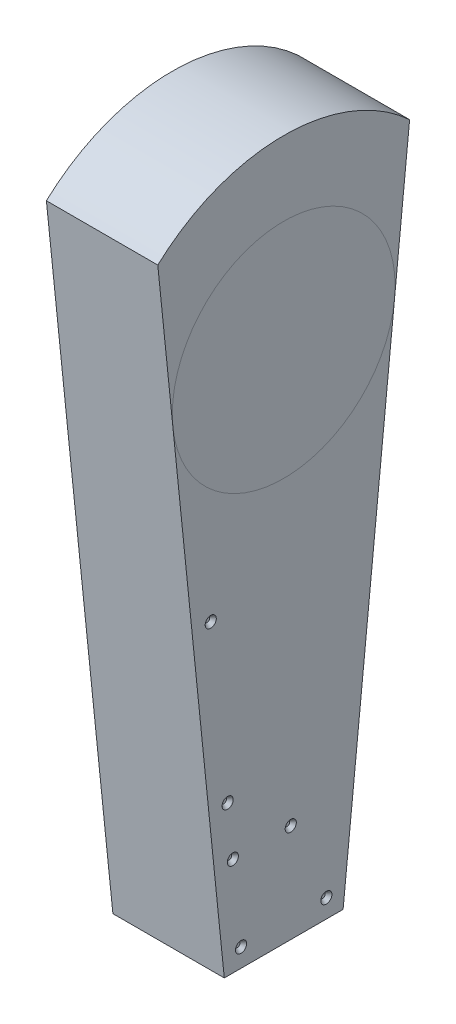
ISO-10303-21;
HEADER;
FILE_DESCRIPTION(('STEP AP214'),'2;1');
FILE_NAME('part.step','',(''),(''),'','','');
FILE_SCHEMA(('AUTOMOTIVE_DESIGN { 1 0 10303 214 1 1 1 1 }'));
ENDSEC;
DATA;
#1=APPLICATION_CONTEXT('core data for automotive mechanical design processes');
#2=APPLICATION_PROTOCOL_DEFINITION('international standard','automotive_design',2000,#1);
#3=PRODUCT_CONTEXT('',#1,'mechanical');
#4=PRODUCT('Part','Part','',(#3));
#5=PRODUCT_RELATED_PRODUCT_CATEGORY('part','',(#4));
#6=PRODUCT_DEFINITION_FORMATION('','',#4);
#7=PRODUCT_DEFINITION_CONTEXT('part definition',#1,'design');
#8=PRODUCT_DEFINITION('design','',#6,#7);
#9=PRODUCT_DEFINITION_SHAPE('','',#8);
#10=(LENGTH_UNIT() NAMED_UNIT(*) SI_UNIT(.MILLI.,.METRE.));
#11=(NAMED_UNIT(*) PLANE_ANGLE_UNIT() SI_UNIT($,.RADIAN.));
#12=(NAMED_UNIT(*) SI_UNIT($,.STERADIAN.) SOLID_ANGLE_UNIT());
#13=UNCERTAINTY_MEASURE_WITH_UNIT(LENGTH_MEASURE(1.E-05),#10,'distance_accuracy_value','');
#14=(GEOMETRIC_REPRESENTATION_CONTEXT(3) GLOBAL_UNCERTAINTY_ASSIGNED_CONTEXT((#13)) GLOBAL_UNIT_ASSIGNED_CONTEXT((#10,
#11,#12)) REPRESENTATION_CONTEXT('',''));
#15=CARTESIAN_POINT('',(0.,0.,0.));
#16=DIRECTION('',(0.,0.,1.));
#17=DIRECTION('',(1.,0.,0.));
#18=AXIS2_PLACEMENT_3D('',#15,#16,#17);
#19=CARTESIAN_POINT('',(76.2,-351.790000010146,40.64));
#20=DIRECTION('',(0.,1.,0.));
#21=DIRECTION('',(0.,0.,1.));
#22=AXIS2_PLACEMENT_3D('',#19,#20,#21);
#23=PLANE('',#22);
#24=DIRECTION('',(0.,0.,-1.));
#25=VECTOR('',#24,1.);
#26=CARTESIAN_POINT('',(0.,-351.790000010146,40.64));
#27=LINE('',#26,#25);
#28=CARTESIAN_POINT('',(0.,-351.790000010146,40.64));
#29=VERTEX_POINT('',#28);
#30=CARTESIAN_POINT('',(0.,-351.790000010146,-40.64));
#31=VERTEX_POINT('',#30);
#32=EDGE_CURVE('E102',#29,#31,#27,.T.);
#33=ORIENTED_EDGE('',*,*,#32,.T.);
#34=DIRECTION('',(-1.,0.,0.));
#35=VECTOR('',#34,1.);
#36=CARTESIAN_POINT('',(76.2,-351.790000010146,-40.64));
#37=LINE('',#36,#35);
#38=CARTESIAN_POINT('',(76.2,-351.790000010146,-40.64));
#39=VERTEX_POINT('',#38);
#40=EDGE_CURVE('E84',#39,#31,#37,.T.);
#41=ORIENTED_EDGE('',*,*,#40,.F.);
#42=DIRECTION('',(0.,0.,-1.));
#43=VECTOR('',#42,1.);
#44=CARTESIAN_POINT('',(76.2,-351.790000010146,40.64));
#45=LINE('',#44,#43);
#46=CARTESIAN_POINT('',(76.2,-351.790000010146,40.64));
#47=VERTEX_POINT('',#46);
#48=EDGE_CURVE('E91',#47,#39,#45,.T.);
#49=ORIENTED_EDGE('',*,*,#48,.F.);
#50=DIRECTION('',(-1.,0.,0.));
#51=VECTOR('',#50,1.);
#52=CARTESIAN_POINT('',(76.2,-351.790000010146,40.64));
#53=LINE('',#52,#51);
#54=EDGE_CURVE('E113',#47,#29,#53,.T.);
#55=ORIENTED_EDGE('',*,*,#54,.T.);
#56=EDGE_LOOP('',(#33,#41,#49,#55));
#57=FACE_BOUND('',#56,.T.);
#58=CARTESIAN_POINT('',(38.1,-351.790000010146,0.));
#59=DIRECTION('',(0.,1.,0.));
#60=DIRECTION('',(0.,0.,1.));
#61=AXIS2_PLACEMENT_3D('',#58,#59,#60);
#62=CIRCLE('',#61,25.4);
#63=CARTESIAN_POINT('',(38.1,-351.790000010146,25.4));
#64=VERTEX_POINT('',#63);
#65=EDGE_CURVE('E11',#64,#64,#62,.F.);
#66=ORIENTED_EDGE('',*,*,#65,.F.);
#67=EDGE_LOOP('',(#66));
#68=FACE_BOUND('',#67,.T.);
#69=ADVANCED_FACE('F35',(#57,#68),#23,.F.);
#70=CARTESIAN_POINT('',(76.2,0.,0.));
#71=DIRECTION('',(1.,0.,0.));
#72=DIRECTION('',(0.,0.,-1.));
#73=AXIS2_PLACEMENT_3D('',#70,#71,#72);
#74=PLANE('',#73);
#75=CARTESIAN_POINT('',(76.2,-284.339077712489,-4.8194607374854));
#76=DIRECTION('',(1.,0.,0.));
#77=DIRECTION('',(0.,0.,-1.));
#78=AXIS2_PLACEMENT_3D('',#75,#76,#77);
#79=CIRCLE('',#78,3.81);
#80=CARTESIAN_POINT('',(76.2,-284.339077712489,-8.6294607374854));
#81=VERTEX_POINT('',#80);
#82=EDGE_CURVE('E158',#81,#81,#79,.T.);
#83=ORIENTED_EDGE('',*,*,#82,.F.);
#84=EDGE_LOOP('',(#83));
#85=FACE_BOUND('',#84,.T.);
#86=CARTESIAN_POINT('',(76.2,-339.090000010146,-29.1719194246492));
#87=DIRECTION('',(1.,0.,0.));
#88=DIRECTION('',(0.,0.,-1.));
#89=AXIS2_PLACEMENT_3D('',#86,#87,#88);
#90=CIRCLE('',#89,3.80999999999999);
#91=CARTESIAN_POINT('',(76.2,-339.090000010146,-32.9819194246492));
#92=VERTEX_POINT('',#91);
#93=EDGE_CURVE('E152',#92,#92,#90,.T.);
#94=ORIENTED_EDGE('',*,*,#93,.F.);
#95=EDGE_LOOP('',(#94));
#96=FACE_BOUND('',#95,.T.);
#97=CARTESIAN_POINT('',(76.2,-339.090000010146,29.1719194246491));
#98=DIRECTION('',(1.,0.,0.));
#99=DIRECTION('',(0.,0.,-1.));
#100=AXIS2_PLACEMENT_3D('',#97,#98,#99);
#101=CIRCLE('',#100,3.81);
#102=CARTESIAN_POINT('',(76.2,-339.090000010146,25.3619194246491));
#103=VERTEX_POINT('',#102);
#104=EDGE_CURVE('E146',#103,#103,#101,.T.);
#105=ORIENTED_EDGE('',*,*,#104,.F.);
#106=EDGE_LOOP('',(#105));
#107=FACE_BOUND('',#106,.T.);
#108=CARTESIAN_POINT('',(76.2,-284.339077712489,34.768096530757));
#109=DIRECTION('',(1.,0.,0.));
#110=DIRECTION('',(0.,0.,-1.));
#111=AXIS2_PLACEMENT_3D('',#108,#109,#110);
#112=CIRCLE('',#111,3.81);
#113=CARTESIAN_POINT('',(76.2,-284.339077712489,30.958096530757));
#114=VERTEX_POINT('',#113);
#115=EDGE_CURVE('E140',#114,#114,#112,.T.);
#116=ORIENTED_EDGE('',*,*,#115,.F.);
#117=EDGE_LOOP('',(#116));
#118=FACE_BOUND('',#117,.T.);
#119=CARTESIAN_POINT('',(76.2,-249.174001321091,38.3623737991144));
#120=DIRECTION('',(1.,0.,0.));
#121=DIRECTION('',(0.,0.,-1.));
#122=AXIS2_PLACEMENT_3D('',#119,#120,#121);
#123=CIRCLE('',#122,3.81);
#124=CARTESIAN_POINT('',(76.2,-249.174001321091,34.5523737991144));
#125=VERTEX_POINT('',#124);
#126=EDGE_CURVE('E134',#125,#125,#123,.T.);
#127=ORIENTED_EDGE('',*,*,#126,.F.);
#128=EDGE_LOOP('',(#127));
#129=FACE_BOUND('',#128,.T.);
#130=CARTESIAN_POINT('',(76.2,-136.12684472737,49.9170998766228));
#131=DIRECTION('',(1.,0.,0.));
#132=DIRECTION('',(0.,0.,-1.));
#133=AXIS2_PLACEMENT_3D('',#130,#131,#132);
#134=CIRCLE('',#133,3.81);
#135=CARTESIAN_POINT('',(76.2,-136.12684472737,46.1070998766228));
#136=VERTEX_POINT('',#135);
#137=EDGE_CURVE('E128',#136,#136,#134,.T.);
#138=ORIENTED_EDGE('',*,*,#137,.F.);
#139=EDGE_LOOP('',(#138));
#140=FACE_BOUND('',#139,.T.);
#141=DIRECTION('',(0.,0.994816974553797,-0.101681793550419));
#142=VECTOR('',#141,1.);
#143=CARTESIAN_POINT('',(76.2,-351.790000010146,-40.64));
#144=LINE('',#143,#142);
#145=CARTESIAN_POINT('',(76.2,-7.74815266854194,-75.8050534609993));
#146=VERTEX_POINT('',#145);
#147=EDGE_CURVE('E80',#39,#146,#144,.T.);
#148=ORIENTED_EDGE('',*,*,#147,.T.);
#149=CARTESIAN_POINT('',(76.2,0.,0.));
#150=DIRECTION('',(1.,0.,0.));
#151=DIRECTION('',(0.,0.,-1.));
#152=AXIS2_PLACEMENT_3D('',#149,#150,#151);
#153=CIRCLE('',#152,76.2);
#154=CARTESIAN_POINT('',(76.2,-7.74815266854197,75.8050534609993));
#155=VERTEX_POINT('',#154);
#156=EDGE_CURVE('E44',#146,#155,#153,.F.);
#157=ORIENTED_EDGE('',*,*,#156,.T.);
#158=DIRECTION('',(0.,-0.994816974553797,-0.101681793550419));
#159=VECTOR('',#158,1.);
#160=CARTESIAN_POINT('',(76.2,-351.790000010146,40.64));
#161=LINE('',#160,#159);
#162=EDGE_CURVE('E94',#155,#47,#161,.T.);
#163=ORIENTED_EDGE('',*,*,#162,.T.);
#164=ORIENTED_EDGE('',*,*,#48,.T.);
#165=EDGE_LOOP('',(#148,#157,#163,#164));
#166=FACE_BOUND('',#165,.T.);
#167=ADVANCED_FACE('F92',(#85,#96,#107,#118,#129,#140,#166),#74,.T.);
#168=CARTESIAN_POINT('',(76.2,93.3252519461238,86.1359236857219));
#169=VERTEX_POINT('',#168);
#170=EDGE_CURVE('E115',#169,#155,#161,.T.);
#171=ORIENTED_EDGE('',*,*,#170,.T.);
#172=EDGE_CURVE('E103',#155,#146,#153,.F.);
#173=ORIENTED_EDGE('',*,*,#172,.T.);
#174=CARTESIAN_POINT('',(76.2,93.3252519461238,-86.1359236857219));
#175=VERTEX_POINT('',#174);
#176=EDGE_CURVE('E87',#146,#175,#144,.T.);
#177=ORIENTED_EDGE('',*,*,#176,.T.);
#178=CARTESIAN_POINT('',(76.2,0.,0.));
#179=DIRECTION('',(1.,0.,0.));
#180=DIRECTION('',(0.,0.,-1.));
#181=AXIS2_PLACEMENT_3D('',#178,#179,#180);
#182=CIRCLE('',#181,127.);
#183=EDGE_CURVE('E88',#175,#169,#182,.T.);
#184=ORIENTED_EDGE('',*,*,#183,.T.);
#185=EDGE_LOOP('',(#171,#173,#177,#184));
#186=FACE_BOUND('',#185,.T.);
#187=ADVANCED_FACE('F248',(#186),#74,.T.);
#188=ORIENTED_EDGE('',*,*,#65,.T.);
#189=EDGE_LOOP('',(#188));
#190=FACE_BOUND('',#189,.T.);
#191=ADVANCED_FACE('F37',(#190),#23,.F.);
#192=CARTESIAN_POINT('',(76.2,-351.790000010146,-40.64));
#193=DIRECTION('',(0.,0.101681793550419,0.994816974553797));
#194=DIRECTION('',(0.,-0.994816974553797,0.101681793550419));
#195=AXIS2_PLACEMENT_3D('',#192,#193,#194);
#196=PLANE('',#195);
#197=DIRECTION('',(0.,0.994816974553797,-0.101681793550419));
#198=VECTOR('',#197,1.);
#199=CARTESIAN_POINT('',(0.,-351.790000010146,-40.64));
#200=LINE('',#199,#198);
#201=CARTESIAN_POINT('',(0.,93.3252519461238,-86.1359236857219));
#202=VERTEX_POINT('',#201);
#203=EDGE_CURVE('E119',#31,#202,#200,.T.);
#204=ORIENTED_EDGE('',*,*,#203,.T.);
#205=DIRECTION('',(-1.,0.,0.));
#206=VECTOR('',#205,1.);
#207=CARTESIAN_POINT('',(76.2,93.3252519461238,-86.1359236857219));
#208=LINE('',#207,#206);
#209=EDGE_CURVE('E104',#175,#202,#208,.T.);
#210=ORIENTED_EDGE('',*,*,#209,.F.);
#211=ORIENTED_EDGE('',*,*,#176,.F.);
#212=ORIENTED_EDGE('',*,*,#147,.F.);
#213=ORIENTED_EDGE('',*,*,#40,.T.);
#214=EDGE_LOOP('',(#204,#210,#211,#212,#213));
#215=FACE_BOUND('',#214,.T.);
#216=ADVANCED_FACE('F82',(#215),#196,.F.);
#217=CARTESIAN_POINT('',(76.2,0.,0.));
#218=DIRECTION('',(-1.,0.,0.));
#219=DIRECTION('',(0.,0.,1.));
#220=AXIS2_PLACEMENT_3D('',#217,#218,#219);
#221=CYLINDRICAL_SURFACE('',#220,127.);
#222=CARTESIAN_POINT('',(0.,0.,0.));
#223=DIRECTION('',(1.,0.,0.));
#224=DIRECTION('',(0.,0.,-1.));
#225=AXIS2_PLACEMENT_3D('',#222,#223,#224);
#226=CIRCLE('',#225,127.);
#227=CARTESIAN_POINT('',(0.,93.3252519461238,86.1359236857219));
#228=VERTEX_POINT('',#227);
#229=EDGE_CURVE('E117',#202,#228,#226,.T.);
#230=ORIENTED_EDGE('',*,*,#229,.T.);
#231=DIRECTION('',(-1.,0.,0.));
#232=VECTOR('',#231,1.);
#233=CARTESIAN_POINT('',(76.2,93.3252519461238,86.1359236857219));
#234=LINE('',#233,#232);
#235=EDGE_CURVE('E108',#169,#228,#234,.T.);
#236=ORIENTED_EDGE('',*,*,#235,.F.);
#237=ORIENTED_EDGE('',*,*,#183,.F.);
#238=ORIENTED_EDGE('',*,*,#209,.T.);
#239=EDGE_LOOP('',(#230,#236,#237,#238));
#240=FACE_BOUND('',#239,.T.);
#241=ADVANCED_FACE('F244',(#240),#221,.T.);
#242=CARTESIAN_POINT('',(76.2,-351.790000010146,40.64));
#243=DIRECTION('',(0.,0.101681793550419,-0.994816974553797));
#244=DIRECTION('',(0.,0.994816974553797,0.10168179355042));
#245=AXIS2_PLACEMENT_3D('',#242,#243,#244);
#246=PLANE('',#245);
#247=DIRECTION('',(0.,-0.994816974553797,-0.101681793550419));
#248=VECTOR('',#247,1.);
#249=CARTESIAN_POINT('',(0.,-351.790000010146,40.64));
#250=LINE('',#249,#248);
#251=EDGE_CURVE('E98',#228,#29,#250,.T.);
#252=ORIENTED_EDGE('',*,*,#251,.T.);
#253=ORIENTED_EDGE('',*,*,#54,.F.);
#254=ORIENTED_EDGE('',*,*,#162,.F.);
#255=ORIENTED_EDGE('',*,*,#170,.F.);
#256=ORIENTED_EDGE('',*,*,#235,.T.);
#257=EDGE_LOOP('',(#252,#253,#254,#255,#256));
#258=FACE_BOUND('',#257,.T.);
#259=ADVANCED_FACE('F250',(#258),#246,.F.);
#260=ORIENTED_EDGE('',*,*,#156,.F.);
#261=ORIENTED_EDGE('',*,*,#172,.F.);
#262=EDGE_LOOP('',(#260,#261));
#263=FACE_BOUND('',#262,.T.);
#264=ADVANCED_FACE('F222',(#263),#74,.T.);
#265=CARTESIAN_POINT('',(0.,0.,0.));
#266=DIRECTION('',(1.,0.,0.));
#267=DIRECTION('',(0.,0.,-1.));
#268=AXIS2_PLACEMENT_3D('',#265,#266,#267);
#269=PLANE('',#268);
#270=CARTESIAN_POINT('',(0.,-152.285748197801,48.2654731666759));
#271=DIRECTION('',(-1.,0.,0.));
#272=DIRECTION('',(0.,0.,1.));
#273=AXIS2_PLACEMENT_3D('',#270,#271,#272);
#274=CIRCLE('',#273,3.81);
#275=CARTESIAN_POINT('',(0.,-152.285748197801,52.0754731666759));
#276=VERTEX_POINT('',#275);
#277=EDGE_CURVE('E212',#276,#276,#274,.T.);
#278=ORIENTED_EDGE('',*,*,#277,.F.);
#279=EDGE_LOOP('',(#278));
#280=FACE_BOUND('',#279,.T.);
#281=CARTESIAN_POINT('',(0.,57.9298746193023,69.7519396294631));
#282=DIRECTION('',(-1.,0.,0.));
#283=DIRECTION('',(0.,0.,1.));
#284=AXIS2_PLACEMENT_3D('',#281,#282,#283);
#285=CIRCLE('',#284,3.81);
#286=CARTESIAN_POINT('',(0.,57.9298746193023,73.5619396294631));
#287=VERTEX_POINT('',#286);
#288=EDGE_CURVE('E206',#287,#287,#285,.T.);
#289=ORIENTED_EDGE('',*,*,#288,.F.);
#290=EDGE_LOOP('',(#289));
#291=FACE_BOUND('',#290,.T.);
#292=CARTESIAN_POINT('',(0.,103.609527071582,48.2654731666759));
#293=DIRECTION('',(-1.,0.,0.));
#294=DIRECTION('',(0.,0.,1.));
#295=AXIS2_PLACEMENT_3D('',#292,#293,#294);
#296=CIRCLE('',#295,3.81);
#297=CARTESIAN_POINT('',(0.,103.609527071582,52.0754731666759));
#298=VERTEX_POINT('',#297);
#299=EDGE_CURVE('E200',#298,#298,#296,.T.);
#300=ORIENTED_EDGE('',*,*,#299,.F.);
#301=EDGE_LOOP('',(#300));
#302=FACE_BOUND('',#301,.T.);
#303=CARTESIAN_POINT('',(0.,103.609527071582,-48.265473166676));
#304=DIRECTION('',(-1.,0.,0.));
#305=DIRECTION('',(0.,0.,1.));
#306=AXIS2_PLACEMENT_3D('',#303,#304,#305);
#307=CIRCLE('',#306,3.81);
#308=CARTESIAN_POINT('',(0.,103.609527071582,-44.455473166676));
#309=VERTEX_POINT('',#308);
#310=EDGE_CURVE('E194',#309,#309,#307,.T.);
#311=ORIENTED_EDGE('',*,*,#310,.F.);
#312=EDGE_LOOP('',(#311));
#313=FACE_BOUND('',#312,.T.);
#314=CARTESIAN_POINT('',(0.,57.9298746193023,-69.7519396294631));
#315=DIRECTION('',(-1.,0.,0.));
#316=DIRECTION('',(0.,0.,1.));
#317=AXIS2_PLACEMENT_3D('',#314,#315,#316);
#318=CIRCLE('',#317,3.81);
#319=CARTESIAN_POINT('',(0.,57.9298746193023,-65.9419396294631));
#320=VERTEX_POINT('',#319);
#321=EDGE_CURVE('E188',#320,#320,#318,.T.);
#322=ORIENTED_EDGE('',*,*,#321,.F.);
#323=EDGE_LOOP('',(#322));
#324=FACE_BOUND('',#323,.T.);
#325=CARTESIAN_POINT('',(0.,-152.285748197801,-48.265473166676));
#326=DIRECTION('',(-1.,0.,0.));
#327=DIRECTION('',(0.,0.,1.));
#328=AXIS2_PLACEMENT_3D('',#325,#326,#327);
#329=CIRCLE('',#328,3.81);
#330=CARTESIAN_POINT('',(0.,-152.285748197801,-44.4554731666759));
#331=VERTEX_POINT('',#330);
#332=EDGE_CURVE('E182',#331,#331,#329,.T.);
#333=ORIENTED_EDGE('',*,*,#332,.F.);
#334=EDGE_LOOP('',(#333));
#335=FACE_BOUND('',#334,.T.);
#336=CARTESIAN_POINT('',(0.,-290.072249351584,-34.1821001214607));
#337=DIRECTION('',(-1.,0.,0.));
#338=DIRECTION('',(0.,0.,1.));
#339=AXIS2_PLACEMENT_3D('',#336,#337,#338);
#340=CIRCLE('',#339,3.81);
#341=CARTESIAN_POINT('',(0.,-290.072249351584,-30.3721001214607));
#342=VERTEX_POINT('',#341);
#343=EDGE_CURVE('E176',#342,#342,#340,.T.);
#344=ORIENTED_EDGE('',*,*,#343,.F.);
#345=EDGE_LOOP('',(#344));
#346=FACE_BOUND('',#345,.T.);
#347=CARTESIAN_POINT('',(0.,-339.090000010146,12.5568506506859));
#348=DIRECTION('',(-1.,0.,0.));
#349=DIRECTION('',(0.,0.,-1.));
#350=AXIS2_PLACEMENT_3D('',#347,#348,#349);
#351=CIRCLE('',#350,3.81);
#352=CARTESIAN_POINT('',(0.,-339.090000010146,8.74685065068594));
#353=VERTEX_POINT('',#352);
#354=EDGE_CURVE('E170',#353,#353,#351,.T.);
#355=ORIENTED_EDGE('',*,*,#354,.F.);
#356=EDGE_LOOP('',(#355));
#357=FACE_BOUND('',#356,.T.);
#358=CARTESIAN_POINT('',(0.,-339.090000010146,-12.556850650686));
#359=DIRECTION('',(-1.,0.,0.));
#360=DIRECTION('',(0.,0.,1.));
#361=AXIS2_PLACEMENT_3D('',#358,#359,#360);
#362=CIRCLE('',#361,3.81);
#363=CARTESIAN_POINT('',(0.,-339.090000010146,-8.746850650686));
#364=VERTEX_POINT('',#363);
#365=EDGE_CURVE('E164',#364,#364,#362,.T.);
#366=ORIENTED_EDGE('',*,*,#365,.F.);
#367=EDGE_LOOP('',(#366));
#368=FACE_BOUND('',#367,.T.);
#369=ORIENTED_EDGE('',*,*,#32,.F.);
#370=ORIENTED_EDGE('',*,*,#251,.F.);
#371=ORIENTED_EDGE('',*,*,#229,.F.);
#372=ORIENTED_EDGE('',*,*,#203,.F.);
#373=EDGE_LOOP('',(#369,#370,#371,#372));
#374=FACE_BOUND('',#373,.T.);
#375=ADVANCED_FACE('F218',(#280,#291,#302,#313,#324,#335,#346,#357,#368,#374),#269,.F.);
#376=CARTESIAN_POINT('',(76.2,-136.12684472737,49.9170998766228));
#377=DIRECTION('',(1.,0.,0.));
#378=DIRECTION('',(0.,0.,-1.));
#379=AXIS2_PLACEMENT_3D('',#376,#377,#378);
#380=CONICAL_SURFACE('',#379,3.81,0.680678408277789);
#381=CARTESIAN_POINT('',(73.66,-136.12684472737,49.9170998766228));
#382=DIRECTION('',(1.,0.,0.));
#383=DIRECTION('',(0.,0.,-1.));
#384=AXIS2_PLACEMENT_3D('',#381,#382,#383);
#385=CIRCLE('',#384,1.75314855568468);
#386=CARTESIAN_POINT('',(73.66,-136.12684472737,48.1639513209381));
#387=VERTEX_POINT('',#386);
#388=EDGE_CURVE('E122',#387,#387,#385,.T.);
#389=ORIENTED_EDGE('',*,*,#388,.F.);
#390=EDGE_LOOP('',(#389));
#391=FACE_BOUND('',#390,.T.);
#392=ORIENTED_EDGE('',*,*,#137,.T.);
#393=EDGE_LOOP('',(#392));
#394=FACE_BOUND('',#393,.T.);
#395=ADVANCED_FACE('F221',(#391,#394),#380,.F.);
#396=CARTESIAN_POINT('',(73.66,-136.12684472737,49.9170998766228));
#397=DIRECTION('',(1.,0.,0.));
#398=DIRECTION('',(0.,0.,-1.));
#399=AXIS2_PLACEMENT_3D('',#396,#397,#398);
#400=PLANE('',#399);
#401=ORIENTED_EDGE('',*,*,#388,.T.);
#402=EDGE_LOOP('',(#401));
#403=FACE_BOUND('',#402,.T.);
#404=ADVANCED_FACE('F277',(#403),#400,.T.);
#405=CARTESIAN_POINT('',(76.2,-249.174001321091,38.3623737991144));
#406=DIRECTION('',(1.,0.,0.));
#407=DIRECTION('',(0.,0.,-1.));
#408=AXIS2_PLACEMENT_3D('',#405,#406,#407);
#409=CONICAL_SURFACE('',#408,3.81,0.680678408277789);
#410=CARTESIAN_POINT('',(73.66,-249.174001321091,38.3623737991144));
#411=DIRECTION('',(1.,0.,0.));
#412=DIRECTION('',(0.,0.,-1.));
#413=AXIS2_PLACEMENT_3D('',#410,#411,#412);
#414=CIRCLE('',#413,1.75314855568468);
#415=CARTESIAN_POINT('',(73.66,-249.174001321091,36.6092252434297));
#416=VERTEX_POINT('',#415);
#417=EDGE_CURVE('E131',#416,#416,#414,.T.);
#418=ORIENTED_EDGE('',*,*,#417,.F.);
#419=EDGE_LOOP('',(#418));
#420=FACE_BOUND('',#419,.T.);
#421=ORIENTED_EDGE('',*,*,#126,.T.);
#422=EDGE_LOOP('',(#421));
#423=FACE_BOUND('',#422,.T.);
#424=ADVANCED_FACE('F281',(#420,#423),#409,.F.);
#425=CARTESIAN_POINT('',(73.66,-249.174001321091,38.3623737991144));
#426=DIRECTION('',(1.,0.,0.));
#427=DIRECTION('',(0.,0.,-1.));
#428=AXIS2_PLACEMENT_3D('',#425,#426,#427);
#429=PLANE('',#428);
#430=ORIENTED_EDGE('',*,*,#417,.T.);
#431=EDGE_LOOP('',(#430));
#432=FACE_BOUND('',#431,.T.);
#433=ADVANCED_FACE('F285',(#432),#429,.T.);
#434=CARTESIAN_POINT('',(76.2,-284.339077712489,34.768096530757));
#435=DIRECTION('',(1.,0.,0.));
#436=DIRECTION('',(0.,0.,-1.));
#437=AXIS2_PLACEMENT_3D('',#434,#435,#436);
#438=CONICAL_SURFACE('',#437,3.81,0.680678408277789);
#439=CARTESIAN_POINT('',(73.66,-284.339077712489,34.768096530757));
#440=DIRECTION('',(1.,0.,0.));
#441=DIRECTION('',(0.,0.,-1.));
#442=AXIS2_PLACEMENT_3D('',#439,#440,#441);
#443=CIRCLE('',#442,1.75314855568468);
#444=CARTESIAN_POINT('',(73.66,-284.339077712489,33.0149479750723));
#445=VERTEX_POINT('',#444);
#446=EDGE_CURVE('E137',#445,#445,#443,.T.);
#447=ORIENTED_EDGE('',*,*,#446,.F.);
#448=EDGE_LOOP('',(#447));
#449=FACE_BOUND('',#448,.T.);
#450=ORIENTED_EDGE('',*,*,#115,.T.);
#451=EDGE_LOOP('',(#450));
#452=FACE_BOUND('',#451,.T.);
#453=ADVANCED_FACE('F289',(#449,#452),#438,.F.);
#454=CARTESIAN_POINT('',(73.66,-284.339077712489,34.768096530757));
#455=DIRECTION('',(1.,0.,0.));
#456=DIRECTION('',(0.,0.,-1.));
#457=AXIS2_PLACEMENT_3D('',#454,#455,#456);
#458=PLANE('',#457);
#459=ORIENTED_EDGE('',*,*,#446,.T.);
#460=EDGE_LOOP('',(#459));
#461=FACE_BOUND('',#460,.T.);
#462=ADVANCED_FACE('F293',(#461),#458,.T.);
#463=CARTESIAN_POINT('',(76.2,-339.090000010146,29.1719194246491));
#464=DIRECTION('',(1.,0.,0.));
#465=DIRECTION('',(0.,0.,-1.));
#466=AXIS2_PLACEMENT_3D('',#463,#464,#465);
#467=CONICAL_SURFACE('',#466,3.81,0.680678408277789);
#468=CARTESIAN_POINT('',(73.66,-339.090000010146,29.1719194246491));
#469=DIRECTION('',(1.,0.,0.));
#470=DIRECTION('',(0.,0.,-1.));
#471=AXIS2_PLACEMENT_3D('',#468,#469,#470);
#472=CIRCLE('',#471,1.75314855568468);
#473=CARTESIAN_POINT('',(73.66,-339.090000010146,27.4187708689645));
#474=VERTEX_POINT('',#473);
#475=EDGE_CURVE('E143',#474,#474,#472,.T.);
#476=ORIENTED_EDGE('',*,*,#475,.F.);
#477=EDGE_LOOP('',(#476));
#478=FACE_BOUND('',#477,.T.);
#479=ORIENTED_EDGE('',*,*,#104,.T.);
#480=EDGE_LOOP('',(#479));
#481=FACE_BOUND('',#480,.T.);
#482=ADVANCED_FACE('F297',(#478,#481),#467,.F.);
#483=CARTESIAN_POINT('',(73.66,-339.090000010146,29.1719194246491));
#484=DIRECTION('',(1.,0.,0.));
#485=DIRECTION('',(0.,0.,-1.));
#486=AXIS2_PLACEMENT_3D('',#483,#484,#485);
#487=PLANE('',#486);
#488=ORIENTED_EDGE('',*,*,#475,.T.);
#489=EDGE_LOOP('',(#488));
#490=FACE_BOUND('',#489,.T.);
#491=ADVANCED_FACE('F301',(#490),#487,.T.);
#492=CARTESIAN_POINT('',(76.2,-339.090000010146,-29.1719194246492));
#493=DIRECTION('',(1.,0.,0.));
#494=DIRECTION('',(0.,0.,-1.));
#495=AXIS2_PLACEMENT_3D('',#492,#493,#494);
#496=CONICAL_SURFACE('',#495,3.80999999999999,0.680678408277789);
#497=CARTESIAN_POINT('',(73.66,-339.090000010146,-29.1719194246492));
#498=DIRECTION('',(1.,0.,0.));
#499=DIRECTION('',(0.,0.,-1.));
#500=AXIS2_PLACEMENT_3D('',#497,#498,#499);
#501=CIRCLE('',#500,1.75314855568467);
#502=CARTESIAN_POINT('',(73.66,-339.090000010146,-30.9250679803339));
#503=VERTEX_POINT('',#502);
#504=EDGE_CURVE('E149',#503,#503,#501,.T.);
#505=ORIENTED_EDGE('',*,*,#504,.F.);
#506=EDGE_LOOP('',(#505));
#507=FACE_BOUND('',#506,.T.);
#508=ORIENTED_EDGE('',*,*,#93,.T.);
#509=EDGE_LOOP('',(#508));
#510=FACE_BOUND('',#509,.T.);
#511=ADVANCED_FACE('F305',(#507,#510),#496,.F.);
#512=CARTESIAN_POINT('',(73.66,-339.090000010146,-29.1719194246492));
#513=DIRECTION('',(1.,0.,0.));
#514=DIRECTION('',(0.,0.,-1.));
#515=AXIS2_PLACEMENT_3D('',#512,#513,#514);
#516=PLANE('',#515);
#517=ORIENTED_EDGE('',*,*,#504,.T.);
#518=EDGE_LOOP('',(#517));
#519=FACE_BOUND('',#518,.T.);
#520=ADVANCED_FACE('F309',(#519),#516,.T.);
#521=CARTESIAN_POINT('',(76.2,-284.339077712489,-4.8194607374854));
#522=DIRECTION('',(1.,0.,0.));
#523=DIRECTION('',(0.,0.,-1.));
#524=AXIS2_PLACEMENT_3D('',#521,#522,#523);
#525=CONICAL_SURFACE('',#524,3.81,0.680678408277789);
#526=CARTESIAN_POINT('',(73.66,-284.339077712489,-4.8194607374854));
#527=DIRECTION('',(1.,0.,0.));
#528=DIRECTION('',(0.,0.,-1.));
#529=AXIS2_PLACEMENT_3D('',#526,#527,#528);
#530=CIRCLE('',#529,1.75314855568468);
#531=CARTESIAN_POINT('',(73.66,-284.339077712489,-6.57260929317008));
#532=VERTEX_POINT('',#531);
#533=EDGE_CURVE('E155',#532,#532,#530,.T.);
#534=ORIENTED_EDGE('',*,*,#533,.F.);
#535=EDGE_LOOP('',(#534));
#536=FACE_BOUND('',#535,.T.);
#537=ORIENTED_EDGE('',*,*,#82,.T.);
#538=EDGE_LOOP('',(#537));
#539=FACE_BOUND('',#538,.T.);
#540=ADVANCED_FACE('F313',(#536,#539),#525,.F.);
#541=CARTESIAN_POINT('',(73.66,-284.339077712489,-4.8194607374854));
#542=DIRECTION('',(1.,0.,0.));
#543=DIRECTION('',(0.,0.,-1.));
#544=AXIS2_PLACEMENT_3D('',#541,#542,#543);
#545=PLANE('',#544);
#546=ORIENTED_EDGE('',*,*,#533,.T.);
#547=EDGE_LOOP('',(#546));
#548=FACE_BOUND('',#547,.T.);
#549=ADVANCED_FACE('F317',(#548),#545,.T.);
#550=CARTESIAN_POINT('',(0.,-339.090000010146,-12.556850650686));
#551=DIRECTION('',(-1.,0.,0.));
#552=DIRECTION('',(0.,0.,1.));
#553=AXIS2_PLACEMENT_3D('',#550,#551,#552);
#554=CONICAL_SURFACE('',#553,3.81,0.680678408277789);
#555=CARTESIAN_POINT('',(2.54,-339.090000010146,-12.556850650686));
#556=DIRECTION('',(-1.,0.,0.));
#557=DIRECTION('',(0.,0.,1.));
#558=AXIS2_PLACEMENT_3D('',#555,#556,#557);
#559=CIRCLE('',#558,1.75314855568468);
#560=CARTESIAN_POINT('',(2.54,-339.090000010146,-10.8037020950013));
#561=VERTEX_POINT('',#560);
#562=EDGE_CURVE('E161',#561,#561,#559,.T.);
#563=ORIENTED_EDGE('',*,*,#562,.F.);
#564=EDGE_LOOP('',(#563));
#565=FACE_BOUND('',#564,.T.);
#566=ORIENTED_EDGE('',*,*,#365,.T.);
#567=EDGE_LOOP('',(#566));
#568=FACE_BOUND('',#567,.T.);
#569=ADVANCED_FACE('F321',(#565,#568),#554,.F.);
#570=CARTESIAN_POINT('',(2.54,-339.090000010146,-12.556850650686));
#571=DIRECTION('',(-1.,0.,0.));
#572=DIRECTION('',(0.,0.,1.));
#573=AXIS2_PLACEMENT_3D('',#570,#571,#572);
#574=PLANE('',#573);
#575=ORIENTED_EDGE('',*,*,#562,.T.);
#576=EDGE_LOOP('',(#575));
#577=FACE_BOUND('',#576,.T.);
#578=ADVANCED_FACE('F325',(#577),#574,.T.);
#579=CARTESIAN_POINT('',(0.,-339.090000010146,12.5568506506859));
#580=DIRECTION('',(-1.,0.,0.));
#581=DIRECTION('',(0.,0.,-1.));
#582=AXIS2_PLACEMENT_3D('',#579,#580,#581);
#583=CONICAL_SURFACE('',#582,3.81,0.680678408277789);
#584=CARTESIAN_POINT('',(2.54,-339.090000010146,12.5568506506859));
#585=DIRECTION('',(1.,0.,0.));
#586=DIRECTION('',(0.,0.,-1.));
#587=AXIS2_PLACEMENT_3D('',#584,#585,#586);
#588=CIRCLE('',#587,1.75314855568468);
#589=CARTESIAN_POINT('',(2.54,-339.090000010146,10.8037020950013));
#590=VERTEX_POINT('',#589);
#591=EDGE_CURVE('E167',#590,#590,#588,.F.);
#592=ORIENTED_EDGE('',*,*,#591,.F.);
#593=EDGE_LOOP('',(#592));
#594=FACE_BOUND('',#593,.T.);
#595=ORIENTED_EDGE('',*,*,#354,.T.);
#596=EDGE_LOOP('',(#595));
#597=FACE_BOUND('',#596,.T.);
#598=ADVANCED_FACE('F329',(#594,#597),#583,.F.);
#599=CARTESIAN_POINT('',(2.54,-339.090000010146,12.5568506506859));
#600=DIRECTION('',(1.,0.,0.));
#601=DIRECTION('',(0.,0.,-1.));
#602=AXIS2_PLACEMENT_3D('',#599,#600,#601);
#603=PLANE('',#602);
#604=ORIENTED_EDGE('',*,*,#591,.T.);
#605=EDGE_LOOP('',(#604));
#606=FACE_BOUND('',#605,.T.);
#607=ADVANCED_FACE('F333',(#606),#603,.F.);
#608=CARTESIAN_POINT('',(0.,-290.072249351584,-34.1821001214607));
#609=DIRECTION('',(-1.,0.,0.));
#610=DIRECTION('',(0.,0.,1.));
#611=AXIS2_PLACEMENT_3D('',#608,#609,#610);
#612=CONICAL_SURFACE('',#611,3.81,0.680678408277789);
#613=CARTESIAN_POINT('',(2.54,-290.072249351584,-34.1821001214607));
#614=DIRECTION('',(-1.,0.,0.));
#615=DIRECTION('',(0.,0.,1.));
#616=AXIS2_PLACEMENT_3D('',#613,#614,#615);
#617=CIRCLE('',#616,1.75314855568468);
#618=CARTESIAN_POINT('',(2.54,-290.072249351584,-32.4289515657761));
#619=VERTEX_POINT('',#618);
#620=EDGE_CURVE('E173',#619,#619,#617,.T.);
#621=ORIENTED_EDGE('',*,*,#620,.F.);
#622=EDGE_LOOP('',(#621));
#623=FACE_BOUND('',#622,.T.);
#624=ORIENTED_EDGE('',*,*,#343,.T.);
#625=EDGE_LOOP('',(#624));
#626=FACE_BOUND('',#625,.T.);
#627=ADVANCED_FACE('F337',(#623,#626),#612,.F.);
#628=CARTESIAN_POINT('',(2.54,-290.072249351584,-34.1821001214607));
#629=DIRECTION('',(-1.,0.,0.));
#630=DIRECTION('',(0.,0.,1.));
#631=AXIS2_PLACEMENT_3D('',#628,#629,#630);
#632=PLANE('',#631);
#633=ORIENTED_EDGE('',*,*,#620,.T.);
#634=EDGE_LOOP('',(#633));
#635=FACE_BOUND('',#634,.T.);
#636=ADVANCED_FACE('F341',(#635),#632,.T.);
#637=CARTESIAN_POINT('',(0.,-152.285748197801,-48.265473166676));
#638=DIRECTION('',(-1.,0.,0.));
#639=DIRECTION('',(0.,0.,1.));
#640=AXIS2_PLACEMENT_3D('',#637,#638,#639);
#641=CONICAL_SURFACE('',#640,3.81,0.680678408277789);
#642=CARTESIAN_POINT('',(2.54,-152.285748197801,-48.265473166676));
#643=DIRECTION('',(-1.,0.,0.));
#644=DIRECTION('',(0.,0.,1.));
#645=AXIS2_PLACEMENT_3D('',#642,#643,#644);
#646=CIRCLE('',#645,1.75314855568468);
#647=CARTESIAN_POINT('',(2.54,-152.285748197801,-46.5123246109913));
#648=VERTEX_POINT('',#647);
#649=EDGE_CURVE('E179',#648,#648,#646,.T.);
#650=ORIENTED_EDGE('',*,*,#649,.F.);
#651=EDGE_LOOP('',(#650));
#652=FACE_BOUND('',#651,.T.);
#653=ORIENTED_EDGE('',*,*,#332,.T.);
#654=EDGE_LOOP('',(#653));
#655=FACE_BOUND('',#654,.T.);
#656=ADVANCED_FACE('F345',(#652,#655),#641,.F.);
#657=CARTESIAN_POINT('',(2.54,-152.285748197801,-48.265473166676));
#658=DIRECTION('',(-1.,0.,0.));
#659=DIRECTION('',(0.,0.,1.));
#660=AXIS2_PLACEMENT_3D('',#657,#658,#659);
#661=PLANE('',#660);
#662=ORIENTED_EDGE('',*,*,#649,.T.);
#663=EDGE_LOOP('',(#662));
#664=FACE_BOUND('',#663,.T.);
#665=ADVANCED_FACE('F349',(#664),#661,.T.);
#666=CARTESIAN_POINT('',(0.,57.9298746193023,-69.7519396294631));
#667=DIRECTION('',(-1.,0.,0.));
#668=DIRECTION('',(0.,0.,1.));
#669=AXIS2_PLACEMENT_3D('',#666,#667,#668);
#670=CONICAL_SURFACE('',#669,3.81,0.680678408277789);
#671=CARTESIAN_POINT('',(2.54,57.9298746193023,-69.7519396294631));
#672=DIRECTION('',(-1.,0.,0.));
#673=DIRECTION('',(0.,0.,1.));
#674=AXIS2_PLACEMENT_3D('',#671,#672,#673);
#675=CIRCLE('',#674,1.75314855568468);
#676=CARTESIAN_POINT('',(2.54,57.9298746193023,-67.9987910737784));
#677=VERTEX_POINT('',#676);
#678=EDGE_CURVE('E185',#677,#677,#675,.T.);
#679=ORIENTED_EDGE('',*,*,#678,.F.);
#680=EDGE_LOOP('',(#679));
#681=FACE_BOUND('',#680,.T.);
#682=ORIENTED_EDGE('',*,*,#321,.T.);
#683=EDGE_LOOP('',(#682));
#684=FACE_BOUND('',#683,.T.);
#685=ADVANCED_FACE('F353',(#681,#684),#670,.F.);
#686=CARTESIAN_POINT('',(2.54,57.9298746193023,-69.7519396294631));
#687=DIRECTION('',(-1.,0.,0.));
#688=DIRECTION('',(0.,0.,1.));
#689=AXIS2_PLACEMENT_3D('',#686,#687,#688);
#690=PLANE('',#689);
#691=ORIENTED_EDGE('',*,*,#678,.T.);
#692=EDGE_LOOP('',(#691));
#693=FACE_BOUND('',#692,.T.);
#694=ADVANCED_FACE('F357',(#693),#690,.T.);
#695=CARTESIAN_POINT('',(0.,103.609527071582,-48.265473166676));
#696=DIRECTION('',(-1.,0.,0.));
#697=DIRECTION('',(0.,0.,1.));
#698=AXIS2_PLACEMENT_3D('',#695,#696,#697);
#699=CONICAL_SURFACE('',#698,3.81,0.680678408277789);
#700=CARTESIAN_POINT('',(2.54,103.609527071582,-48.265473166676));
#701=DIRECTION('',(-1.,0.,0.));
#702=DIRECTION('',(0.,0.,1.));
#703=AXIS2_PLACEMENT_3D('',#700,#701,#702);
#704=CIRCLE('',#703,1.75314855568468);
#705=CARTESIAN_POINT('',(2.54,103.609527071582,-46.5123246109913));
#706=VERTEX_POINT('',#705);
#707=EDGE_CURVE('E191',#706,#706,#704,.T.);
#708=ORIENTED_EDGE('',*,*,#707,.F.);
#709=EDGE_LOOP('',(#708));
#710=FACE_BOUND('',#709,.T.);
#711=ORIENTED_EDGE('',*,*,#310,.T.);
#712=EDGE_LOOP('',(#711));
#713=FACE_BOUND('',#712,.T.);
#714=ADVANCED_FACE('F361',(#710,#713),#699,.F.);
#715=CARTESIAN_POINT('',(2.54,103.609527071582,-48.265473166676));
#716=DIRECTION('',(-1.,0.,0.));
#717=DIRECTION('',(0.,0.,1.));
#718=AXIS2_PLACEMENT_3D('',#715,#716,#717);
#719=PLANE('',#718);
#720=ORIENTED_EDGE('',*,*,#707,.T.);
#721=EDGE_LOOP('',(#720));
#722=FACE_BOUND('',#721,.T.);
#723=ADVANCED_FACE('F365',(#722),#719,.T.);
#724=CARTESIAN_POINT('',(0.,103.609527071582,48.2654731666759));
#725=DIRECTION('',(-1.,0.,0.));
#726=DIRECTION('',(0.,0.,1.));
#727=AXIS2_PLACEMENT_3D('',#724,#725,#726);
#728=CONICAL_SURFACE('',#727,3.81,0.680678408277789);
#729=CARTESIAN_POINT('',(2.54,103.609527071582,48.2654731666759));
#730=DIRECTION('',(-1.,0.,0.));
#731=DIRECTION('',(0.,0.,1.));
#732=AXIS2_PLACEMENT_3D('',#729,#730,#731);
#733=CIRCLE('',#732,1.75314855568468);
#734=CARTESIAN_POINT('',(2.54,103.609527071582,50.0186217223606));
#735=VERTEX_POINT('',#734);
#736=EDGE_CURVE('E197',#735,#735,#733,.T.);
#737=ORIENTED_EDGE('',*,*,#736,.F.);
#738=EDGE_LOOP('',(#737));
#739=FACE_BOUND('',#738,.T.);
#740=ORIENTED_EDGE('',*,*,#299,.T.);
#741=EDGE_LOOP('',(#740));
#742=FACE_BOUND('',#741,.T.);
#743=ADVANCED_FACE('F369',(#739,#742),#728,.F.);
#744=CARTESIAN_POINT('',(2.54,103.609527071582,48.2654731666759));
#745=DIRECTION('',(-1.,0.,0.));
#746=DIRECTION('',(0.,0.,1.));
#747=AXIS2_PLACEMENT_3D('',#744,#745,#746);
#748=PLANE('',#747);
#749=ORIENTED_EDGE('',*,*,#736,.T.);
#750=EDGE_LOOP('',(#749));
#751=FACE_BOUND('',#750,.T.);
#752=ADVANCED_FACE('F373',(#751),#748,.T.);
#753=CARTESIAN_POINT('',(0.,57.9298746193023,69.7519396294631));
#754=DIRECTION('',(-1.,0.,0.));
#755=DIRECTION('',(0.,0.,1.));
#756=AXIS2_PLACEMENT_3D('',#753,#754,#755);
#757=CONICAL_SURFACE('',#756,3.81,0.680678408277789);
#758=CARTESIAN_POINT('',(2.54,57.9298746193023,69.7519396294631));
#759=DIRECTION('',(-1.,0.,0.));
#760=DIRECTION('',(0.,0.,1.));
#761=AXIS2_PLACEMENT_3D('',#758,#759,#760);
#762=CIRCLE('',#761,1.75314855568468);
#763=CARTESIAN_POINT('',(2.54,57.9298746193023,71.5050881851478));
#764=VERTEX_POINT('',#763);
#765=EDGE_CURVE('E203',#764,#764,#762,.T.);
#766=ORIENTED_EDGE('',*,*,#765,.F.);
#767=EDGE_LOOP('',(#766));
#768=FACE_BOUND('',#767,.T.);
#769=ORIENTED_EDGE('',*,*,#288,.T.);
#770=EDGE_LOOP('',(#769));
#771=FACE_BOUND('',#770,.T.);
#772=ADVANCED_FACE('F377',(#768,#771),#757,.F.);
#773=CARTESIAN_POINT('',(2.54,57.9298746193023,69.7519396294631));
#774=DIRECTION('',(-1.,0.,0.));
#775=DIRECTION('',(0.,0.,1.));
#776=AXIS2_PLACEMENT_3D('',#773,#774,#775);
#777=PLANE('',#776);
#778=ORIENTED_EDGE('',*,*,#765,.T.);
#779=EDGE_LOOP('',(#778));
#780=FACE_BOUND('',#779,.T.);
#781=ADVANCED_FACE('F381',(#780),#777,.T.);
#782=CARTESIAN_POINT('',(0.,-152.285748197801,48.2654731666759));
#783=DIRECTION('',(-1.,0.,0.));
#784=DIRECTION('',(0.,0.,1.));
#785=AXIS2_PLACEMENT_3D('',#782,#783,#784);
#786=CONICAL_SURFACE('',#785,3.81,0.680678408277789);
#787=CARTESIAN_POINT('',(2.54,-152.285748197801,48.2654731666759));
#788=DIRECTION('',(-1.,0.,0.));
#789=DIRECTION('',(0.,0.,1.));
#790=AXIS2_PLACEMENT_3D('',#787,#788,#789);
#791=CIRCLE('',#790,1.75314855568468);
#792=CARTESIAN_POINT('',(2.54,-152.285748197801,50.0186217223606));
#793=VERTEX_POINT('',#792);
#794=EDGE_CURVE('E209',#793,#793,#791,.T.);
#795=ORIENTED_EDGE('',*,*,#794,.F.);
#796=EDGE_LOOP('',(#795));
#797=FACE_BOUND('',#796,.T.);
#798=ORIENTED_EDGE('',*,*,#277,.T.);
#799=EDGE_LOOP('',(#798));
#800=FACE_BOUND('',#799,.T.);
#801=ADVANCED_FACE('F216',(#797,#800),#786,.F.);
#802=CARTESIAN_POINT('',(2.54,-152.285748197801,48.2654731666759));
#803=DIRECTION('',(-1.,0.,0.));
#804=DIRECTION('',(0.,0.,1.));
#805=AXIS2_PLACEMENT_3D('',#802,#803,#804);
#806=PLANE('',#805);
#807=ORIENTED_EDGE('',*,*,#794,.T.);
#808=EDGE_LOOP('',(#807));
#809=FACE_BOUND('',#808,.T.);
#810=ADVANCED_FACE('F388',(#809),#806,.T.);
#811=CLOSED_SHELL('',(#69,#167,#187,#191,#216,#241,#259,#264,#375,#395,#404,#424,#433,#453,#462,
#482,#491,#511,#520,#540,#549,#569,#578,#598,#607,#627,#636,#656,#665,#685,#694,#714,#723,#743,
#752,#772,#781,#801,#810));
#812=MANIFOLD_SOLID_BREP('B2',#811);
#813=ADVANCED_BREP_SHAPE_REPRESENTATION('',(#18,#812),#14);
#814=SHAPE_DEFINITION_REPRESENTATION(#9,#813);
ENDSEC;
END-ISO-10303-21;
